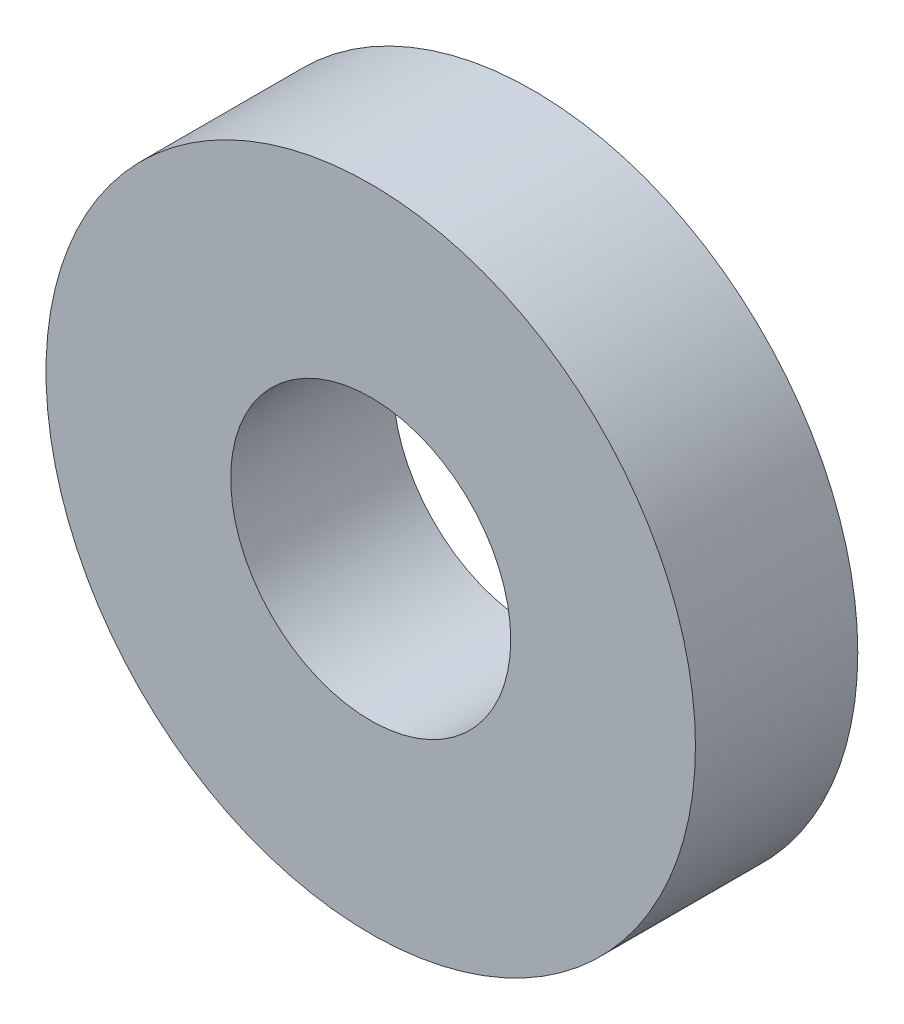
ISO-10303-21;
HEADER;
FILE_DESCRIPTION(('STEP AP214'),'2;1');
FILE_NAME('part.step','',(''),(''),'','','');
FILE_SCHEMA(('AUTOMOTIVE_DESIGN { 1 0 10303 214 1 1 1 1 }'));
ENDSEC;
DATA;
#1=APPLICATION_CONTEXT('core data for automotive mechanical design processes');
#2=APPLICATION_PROTOCOL_DEFINITION('international standard','automotive_design',2000,#1);
#3=PRODUCT_CONTEXT('',#1,'mechanical');
#4=PRODUCT('Part','Part','',(#3));
#5=PRODUCT_RELATED_PRODUCT_CATEGORY('part','',(#4));
#6=PRODUCT_DEFINITION_FORMATION('','',#4);
#7=PRODUCT_DEFINITION_CONTEXT('part definition',#1,'design');
#8=PRODUCT_DEFINITION('design','',#6,#7);
#9=PRODUCT_DEFINITION_SHAPE('','',#8);
#10=(LENGTH_UNIT() NAMED_UNIT(*) SI_UNIT(.MILLI.,.METRE.));
#11=(NAMED_UNIT(*) PLANE_ANGLE_UNIT() SI_UNIT($,.RADIAN.));
#12=(NAMED_UNIT(*) SI_UNIT($,.STERADIAN.) SOLID_ANGLE_UNIT());
#13=UNCERTAINTY_MEASURE_WITH_UNIT(LENGTH_MEASURE(1.E-05),#10,'distance_accuracy_value','');
#14=(GEOMETRIC_REPRESENTATION_CONTEXT(3) GLOBAL_UNCERTAINTY_ASSIGNED_CONTEXT((#13)) GLOBAL_UNIT_ASSIGNED_CONTEXT((#10,
#11,#12)) REPRESENTATION_CONTEXT('',''));
#15=CARTESIAN_POINT('',(0.,0.,0.));
#16=DIRECTION('',(0.,0.,1.));
#17=DIRECTION('',(1.,0.,0.));
#18=AXIS2_PLACEMENT_3D('',#15,#16,#17);
#19=CARTESIAN_POINT('',(0.,0.,2.));
#20=DIRECTION('',(0.,0.,1.));
#21=DIRECTION('',(1.,0.,0.));
#22=AXIS2_PLACEMENT_3D('',#19,#20,#21);
#23=PLANE('',#22);
#24=CARTESIAN_POINT('',(0.,0.,2.));
#25=DIRECTION('',(0.,0.,1.));
#26=DIRECTION('',(1.,0.,0.));
#27=AXIS2_PLACEMENT_3D('',#24,#25,#26);
#28=CIRCLE('',#27,4.);
#29=CARTESIAN_POINT('',(4.,0.,2.));
#30=VERTEX_POINT('',#29);
#31=EDGE_CURVE('E10',#30,#30,#28,.T.);
#32=ORIENTED_EDGE('',*,*,#31,.T.);
#33=EDGE_LOOP('',(#32));
#34=FACE_BOUND('',#33,.T.);
#35=CARTESIAN_POINT('',(0.,0.,2.));
#36=DIRECTION('',(0.,0.,1.));
#37=DIRECTION('',(1.,0.,0.));
#38=AXIS2_PLACEMENT_3D('',#35,#36,#37);
#39=CIRCLE('',#38,1.725);
#40=CARTESIAN_POINT('',(1.725,0.,2.));
#41=VERTEX_POINT('',#40);
#42=EDGE_CURVE('E41',#41,#41,#39,.T.);
#43=ORIENTED_EDGE('',*,*,#42,.F.);
#44=EDGE_LOOP('',(#43));
#45=FACE_BOUND('',#44,.T.);
#46=ADVANCED_FACE('F30',(#34,#45),#23,.T.);
#47=CARTESIAN_POINT('',(0.,0.,0.));
#48=DIRECTION('',(0.,0.,1.));
#49=DIRECTION('',(1.,0.,0.));
#50=AXIS2_PLACEMENT_3D('',#47,#48,#49);
#51=PLANE('',#50);
#52=CARTESIAN_POINT('',(0.,0.,0.));
#53=DIRECTION('',(0.,0.,1.));
#54=DIRECTION('',(1.,0.,0.));
#55=AXIS2_PLACEMENT_3D('',#52,#53,#54);
#56=CIRCLE('',#55,4.);
#57=CARTESIAN_POINT('',(4.,0.,0.));
#58=VERTEX_POINT('',#57);
#59=EDGE_CURVE('E34',#58,#58,#56,.T.);
#60=ORIENTED_EDGE('',*,*,#59,.F.);
#61=EDGE_LOOP('',(#60));
#62=FACE_BOUND('',#61,.T.);
#63=CARTESIAN_POINT('',(0.,0.,0.));
#64=DIRECTION('',(0.,0.,1.));
#65=DIRECTION('',(1.,0.,0.));
#66=AXIS2_PLACEMENT_3D('',#63,#64,#65);
#67=CIRCLE('',#66,1.725);
#68=CARTESIAN_POINT('',(1.725,0.,0.));
#69=VERTEX_POINT('',#68);
#70=EDGE_CURVE('E43',#69,#69,#67,.T.);
#71=ORIENTED_EDGE('',*,*,#70,.T.);
#72=EDGE_LOOP('',(#71));
#73=FACE_BOUND('',#72,.T.);
#74=ADVANCED_FACE('F53',(#62,#73),#51,.F.);
#75=CARTESIAN_POINT('',(0.,0.,2.));
#76=DIRECTION('',(0.,0.,-1.));
#77=DIRECTION('',(-1.,0.,0.));
#78=AXIS2_PLACEMENT_3D('',#75,#76,#77);
#79=CYLINDRICAL_SURFACE('',#78,4.);
#80=ORIENTED_EDGE('',*,*,#31,.F.);
#81=EDGE_LOOP('',(#80));
#82=FACE_BOUND('',#81,.T.);
#83=ORIENTED_EDGE('',*,*,#59,.T.);
#84=EDGE_LOOP('',(#83));
#85=FACE_BOUND('',#84,.T.);
#86=ADVANCED_FACE('F32',(#82,#85),#79,.T.);
#87=CARTESIAN_POINT('',(0.,0.,2.));
#88=DIRECTION('',(0.,0.,-1.));
#89=DIRECTION('',(-1.,0.,0.));
#90=AXIS2_PLACEMENT_3D('',#87,#88,#89);
#91=CYLINDRICAL_SURFACE('',#90,1.725);
#92=ORIENTED_EDGE('',*,*,#42,.T.);
#93=EDGE_LOOP('',(#92));
#94=FACE_BOUND('',#93,.T.);
#95=ORIENTED_EDGE('',*,*,#70,.F.);
#96=EDGE_LOOP('',(#95));
#97=FACE_BOUND('',#96,.T.);
#98=ADVANCED_FACE('F49',(#94,#97),#91,.F.);
#99=CLOSED_SHELL('',(#46,#74,#86,#98));
#100=MANIFOLD_SOLID_BREP('B2',#99);
#101=ADVANCED_BREP_SHAPE_REPRESENTATION('',(#18,#100),#14);
#102=SHAPE_DEFINITION_REPRESENTATION(#9,#101);
ENDSEC;
END-ISO-10303-21;
